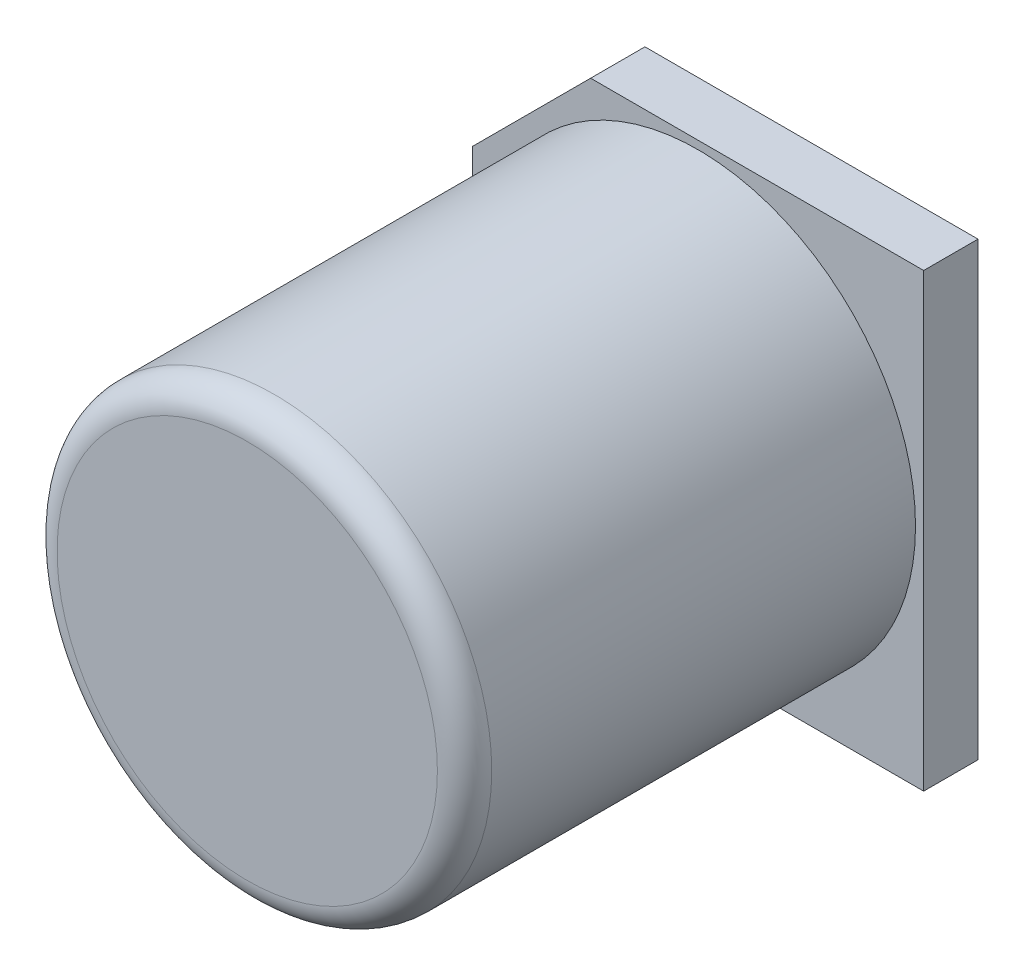
ISO-10303-21;
HEADER;
FILE_DESCRIPTION(('STEP AP214'),'2;1');
FILE_NAME('part.step','',(''),(''),'','','');
FILE_SCHEMA(('AUTOMOTIVE_DESIGN { 1 0 10303 214 1 1 1 1 }'));
ENDSEC;
DATA;
#1=APPLICATION_CONTEXT('core data for automotive mechanical design processes');
#2=APPLICATION_PROTOCOL_DEFINITION('international standard','automotive_design',2000,#1);
#3=PRODUCT_CONTEXT('',#1,'mechanical');
#4=PRODUCT('Part','Part','',(#3));
#5=PRODUCT_RELATED_PRODUCT_CATEGORY('part','',(#4));
#6=PRODUCT_DEFINITION_FORMATION('','',#4);
#7=PRODUCT_DEFINITION_CONTEXT('part definition',#1,'design');
#8=PRODUCT_DEFINITION('design','',#6,#7);
#9=PRODUCT_DEFINITION_SHAPE('','',#8);
#10=(LENGTH_UNIT() NAMED_UNIT(*) SI_UNIT(.MILLI.,.METRE.));
#11=(NAMED_UNIT(*) PLANE_ANGLE_UNIT() SI_UNIT($,.RADIAN.));
#12=(NAMED_UNIT(*) SI_UNIT($,.STERADIAN.) SOLID_ANGLE_UNIT());
#13=UNCERTAINTY_MEASURE_WITH_UNIT(LENGTH_MEASURE(1.E-05),#10,'distance_accuracy_value','');
#14=(GEOMETRIC_REPRESENTATION_CONTEXT(3) GLOBAL_UNCERTAINTY_ASSIGNED_CONTEXT((#13)) GLOBAL_UNIT_ASSIGNED_CONTEXT((#10,
#11,#12)) REPRESENTATION_CONTEXT('',''));
#15=CARTESIAN_POINT('',(0.,0.,0.));
#16=DIRECTION('',(0.,0.,1.));
#17=DIRECTION('',(1.,0.,0.));
#18=AXIS2_PLACEMENT_3D('',#15,#16,#17);
#19=CARTESIAN_POINT('',(4.15,4.15,1.));
#20=DIRECTION('',(-1.,0.,0.));
#21=DIRECTION('',(0.,0.,1.));
#22=AXIS2_PLACEMENT_3D('',#19,#20,#21);
#23=PLANE('',#22);
#24=DIRECTION('',(0.,1.,0.));
#25=VECTOR('',#24,1.);
#26=CARTESIAN_POINT('',(4.15,4.15,0.));
#27=LINE('',#26,#25);
#28=CARTESIAN_POINT('',(4.15,-4.15,0.));
#29=VERTEX_POINT('',#28);
#30=CARTESIAN_POINT('',(4.15,4.15,0.));
#31=VERTEX_POINT('',#30);
#32=EDGE_CURVE('E120',#29,#31,#27,.T.);
#33=ORIENTED_EDGE('',*,*,#32,.T.);
#34=DIRECTION('',(0.,0.,-1.));
#35=VECTOR('',#34,1.);
#36=CARTESIAN_POINT('',(4.15,4.15,1.));
#37=LINE('',#36,#35);
#38=CARTESIAN_POINT('',(4.15,4.15,1.));
#39=VERTEX_POINT('',#38);
#40=EDGE_CURVE('E137',#39,#31,#37,.T.);
#41=ORIENTED_EDGE('',*,*,#40,.F.);
#42=DIRECTION('',(0.,1.,0.));
#43=VECTOR('',#42,1.);
#44=CARTESIAN_POINT('',(4.15,4.15,1.));
#45=LINE('',#44,#43);
#46=CARTESIAN_POINT('',(4.15,-4.15,1.));
#47=VERTEX_POINT('',#46);
#48=EDGE_CURVE('E130',#47,#39,#45,.T.);
#49=ORIENTED_EDGE('',*,*,#48,.F.);
#50=DIRECTION('',(0.,0.,-1.));
#51=VECTOR('',#50,1.);
#52=CARTESIAN_POINT('',(4.15,-4.15,1.));
#53=LINE('',#52,#51);
#54=EDGE_CURVE('E116',#47,#29,#53,.T.);
#55=ORIENTED_EDGE('',*,*,#54,.T.);
#56=EDGE_LOOP('',(#33,#41,#49,#55));
#57=FACE_BOUND('',#56,.T.);
#58=ADVANCED_FACE('F34',(#57),#23,.F.);
#59=CARTESIAN_POINT('',(4.15,4.15,1.));
#60=DIRECTION('',(0.,-1.,0.));
#61=DIRECTION('',(1.,0.,0.));
#62=AXIS2_PLACEMENT_3D('',#59,#60,#61);
#63=PLANE('',#62);
#64=DIRECTION('',(-1.,0.,0.));
#65=VECTOR('',#64,1.);
#66=CARTESIAN_POINT('',(4.15,4.15,0.));
#67=LINE('',#66,#65);
#68=CARTESIAN_POINT('',(-1.98,4.15,0.));
#69=VERTEX_POINT('',#68);
#70=EDGE_CURVE('E123',#31,#69,#67,.T.);
#71=ORIENTED_EDGE('',*,*,#70,.T.);
#72=DIRECTION('',(0.,0.,-1.));
#73=VECTOR('',#72,1.);
#74=CARTESIAN_POINT('',(-1.98,4.15,1.));
#75=LINE('',#74,#73);
#76=CARTESIAN_POINT('',(-1.98,4.15,1.));
#77=VERTEX_POINT('',#76);
#78=EDGE_CURVE('E134',#77,#69,#75,.T.);
#79=ORIENTED_EDGE('',*,*,#78,.F.);
#80=DIRECTION('',(-1.,0.,0.));
#81=VECTOR('',#80,1.);
#82=CARTESIAN_POINT('',(4.15,4.15,1.));
#83=LINE('',#82,#81);
#84=EDGE_CURVE('E89',#39,#77,#83,.T.);
#85=ORIENTED_EDGE('',*,*,#84,.F.);
#86=ORIENTED_EDGE('',*,*,#40,.T.);
#87=EDGE_LOOP('',(#71,#79,#85,#86));
#88=FACE_BOUND('',#87,.T.);
#89=ADVANCED_FACE('F150',(#88),#63,.F.);
#90=CARTESIAN_POINT('',(-1.98,4.15,1.));
#91=DIRECTION('',(0.707106781186548,-0.707106781186547,0.));
#92=DIRECTION('',(0.707106781186547,0.707106781186548,0.));
#93=AXIS2_PLACEMENT_3D('',#90,#91,#92);
#94=PLANE('',#93);
#95=DIRECTION('',(-0.707106781186547,-0.707106781186548,0.));
#96=VECTOR('',#95,1.);
#97=CARTESIAN_POINT('',(-1.98,4.15,0.));
#98=LINE('',#97,#96);
#99=CARTESIAN_POINT('',(-4.15,1.98,0.));
#100=VERTEX_POINT('',#99);
#101=EDGE_CURVE('E125',#69,#100,#98,.T.);
#102=ORIENTED_EDGE('',*,*,#101,.T.);
#103=DIRECTION('',(0.,0.,-1.));
#104=VECTOR('',#103,1.);
#105=CARTESIAN_POINT('',(-4.15,1.98,1.));
#106=LINE('',#105,#104);
#107=CARTESIAN_POINT('',(-4.15,1.98,1.));
#108=VERTEX_POINT('',#107);
#109=EDGE_CURVE('E111',#108,#100,#106,.T.);
#110=ORIENTED_EDGE('',*,*,#109,.F.);
#111=DIRECTION('',(-0.707106781186547,-0.707106781186548,0.));
#112=VECTOR('',#111,1.);
#113=CARTESIAN_POINT('',(-1.98,4.15,1.));
#114=LINE('',#113,#112);
#115=EDGE_CURVE('E102',#77,#108,#114,.T.);
#116=ORIENTED_EDGE('',*,*,#115,.F.);
#117=ORIENTED_EDGE('',*,*,#78,.T.);
#118=EDGE_LOOP('',(#102,#110,#116,#117));
#119=FACE_BOUND('',#118,.T.);
#120=ADVANCED_FACE('F153',(#119),#94,.F.);
#121=CARTESIAN_POINT('',(-4.15,1.98,1.));
#122=DIRECTION('',(1.,0.,0.));
#123=DIRECTION('',(0.,1.,0.));
#124=AXIS2_PLACEMENT_3D('',#121,#122,#123);
#125=PLANE('',#124);
#126=DIRECTION('',(0.,-1.,0.));
#127=VECTOR('',#126,1.);
#128=CARTESIAN_POINT('',(-4.15,1.98,0.));
#129=LINE('',#128,#127);
#130=CARTESIAN_POINT('',(-4.15,-1.98,0.));
#131=VERTEX_POINT('',#130);
#132=EDGE_CURVE('E110',#100,#131,#129,.T.);
#133=ORIENTED_EDGE('',*,*,#132,.T.);
#134=DIRECTION('',(0.,0.,-1.));
#135=VECTOR('',#134,1.);
#136=CARTESIAN_POINT('',(-4.15,-1.98,1.));
#137=LINE('',#136,#135);
#138=CARTESIAN_POINT('',(-4.15,-1.98,1.));
#139=VERTEX_POINT('',#138);
#140=EDGE_CURVE('E107',#139,#131,#137,.T.);
#141=ORIENTED_EDGE('',*,*,#140,.F.);
#142=DIRECTION('',(0.,-1.,0.));
#143=VECTOR('',#142,1.);
#144=CARTESIAN_POINT('',(-4.15,1.98,1.));
#145=LINE('',#144,#143);
#146=EDGE_CURVE('E96',#108,#139,#145,.T.);
#147=ORIENTED_EDGE('',*,*,#146,.F.);
#148=ORIENTED_EDGE('',*,*,#109,.T.);
#149=EDGE_LOOP('',(#133,#141,#147,#148));
#150=FACE_BOUND('',#149,.T.);
#151=ADVANCED_FACE('F108',(#150),#125,.F.);
#152=CARTESIAN_POINT('',(-1.98,-4.15,1.));
#153=DIRECTION('',(0.707106781186547,0.707106781186548,0.));
#154=DIRECTION('',(-0.707106781186548,0.707106781186547,0.));
#155=AXIS2_PLACEMENT_3D('',#152,#153,#154);
#156=PLANE('',#155);
#157=DIRECTION('',(0.707106781186548,-0.707106781186547,0.));
#158=VECTOR('',#157,1.);
#159=CARTESIAN_POINT('',(-1.98,-4.15,0.));
#160=LINE('',#159,#158);
#161=CARTESIAN_POINT('',(-1.98,-4.15,0.));
#162=VERTEX_POINT('',#161);
#163=EDGE_CURVE('E74',#131,#162,#160,.T.);
#164=ORIENTED_EDGE('',*,*,#163,.T.);
#165=DIRECTION('',(0.,0.,-1.));
#166=VECTOR('',#165,1.);
#167=CARTESIAN_POINT('',(-1.98,-4.15,1.));
#168=LINE('',#167,#166);
#169=CARTESIAN_POINT('',(-1.98,-4.15,1.));
#170=VERTEX_POINT('',#169);
#171=EDGE_CURVE('E112',#170,#162,#168,.T.);
#172=ORIENTED_EDGE('',*,*,#171,.F.);
#173=DIRECTION('',(0.707106781186548,-0.707106781186547,0.));
#174=VECTOR('',#173,1.);
#175=CARTESIAN_POINT('',(-1.98,-4.15,1.));
#176=LINE('',#175,#174);
#177=EDGE_CURVE('E100',#139,#170,#176,.T.);
#178=ORIENTED_EDGE('',*,*,#177,.F.);
#179=ORIENTED_EDGE('',*,*,#140,.T.);
#180=EDGE_LOOP('',(#164,#172,#178,#179));
#181=FACE_BOUND('',#180,.T.);
#182=ADVANCED_FACE('F114',(#181),#156,.F.);
#183=CARTESIAN_POINT('',(4.15,-4.15,1.));
#184=DIRECTION('',(0.,1.,0.));
#185=DIRECTION('',(-1.,0.,0.));
#186=AXIS2_PLACEMENT_3D('',#183,#184,#185);
#187=PLANE('',#186);
#188=DIRECTION('',(1.,0.,0.));
#189=VECTOR('',#188,1.);
#190=CARTESIAN_POINT('',(4.15,-4.15,0.));
#191=LINE('',#190,#189);
#192=EDGE_CURVE('E80',#162,#29,#191,.T.);
#193=ORIENTED_EDGE('',*,*,#192,.T.);
#194=ORIENTED_EDGE('',*,*,#54,.F.);
#195=DIRECTION('',(1.,0.,0.));
#196=VECTOR('',#195,1.);
#197=CARTESIAN_POINT('',(4.15,-4.15,1.));
#198=LINE('',#197,#196);
#199=EDGE_CURVE('E51',#170,#47,#198,.T.);
#200=ORIENTED_EDGE('',*,*,#199,.F.);
#201=ORIENTED_EDGE('',*,*,#171,.T.);
#202=EDGE_LOOP('',(#193,#194,#200,#201));
#203=FACE_BOUND('',#202,.T.);
#204=ADVANCED_FACE('F158',(#203),#187,.F.);
#205=CARTESIAN_POINT('',(0.,0.,1.));
#206=DIRECTION('',(0.,0.,-1.));
#207=DIRECTION('',(-1.,0.,0.));
#208=AXIS2_PLACEMENT_3D('',#205,#206,#207);
#209=PLANE('',#208);
#210=CARTESIAN_POINT('',(0.,0.,1.));
#211=DIRECTION('',(0.,0.,1.));
#212=DIRECTION('',(1.,0.,0.));
#213=AXIS2_PLACEMENT_3D('',#210,#211,#212);
#214=CIRCLE('',#213,4.);
#215=CARTESIAN_POINT('',(4.,0.,1.));
#216=VERTEX_POINT('',#215);
#217=EDGE_CURVE('E138',#216,#216,#214,.T.);
#218=ORIENTED_EDGE('',*,*,#217,.F.);
#219=EDGE_LOOP('',(#218));
#220=FACE_BOUND('',#219,.T.);
#221=ORIENTED_EDGE('',*,*,#48,.T.);
#222=ORIENTED_EDGE('',*,*,#84,.T.);
#223=ORIENTED_EDGE('',*,*,#115,.T.);
#224=ORIENTED_EDGE('',*,*,#146,.T.);
#225=ORIENTED_EDGE('',*,*,#177,.T.);
#226=ORIENTED_EDGE('',*,*,#199,.T.);
#227=EDGE_LOOP('',(#221,#222,#223,#224,#225,#226));
#228=FACE_BOUND('',#227,.T.);
#229=ADVANCED_FACE('F98',(#220,#228),#209,.F.);
#230=CARTESIAN_POINT('',(0.,0.,0.));
#231=DIRECTION('',(0.,0.,-1.));
#232=DIRECTION('',(-1.,0.,0.));
#233=AXIS2_PLACEMENT_3D('',#230,#231,#232);
#234=PLANE('',#233);
#235=ORIENTED_EDGE('',*,*,#32,.F.);
#236=ORIENTED_EDGE('',*,*,#192,.F.);
#237=ORIENTED_EDGE('',*,*,#163,.F.);
#238=ORIENTED_EDGE('',*,*,#132,.F.);
#239=ORIENTED_EDGE('',*,*,#101,.F.);
#240=ORIENTED_EDGE('',*,*,#70,.F.);
#241=EDGE_LOOP('',(#235,#236,#237,#238,#239,#240));
#242=FACE_BOUND('',#241,.T.);
#243=ADVANCED_FACE('F156',(#242),#234,.T.);
#244=CARTESIAN_POINT('',(0.,0.,9.3));
#245=DIRECTION('',(0.,0.,-1.));
#246=DIRECTION('',(-1.,0.,0.));
#247=AXIS2_PLACEMENT_3D('',#244,#245,#246);
#248=CYLINDRICAL_SURFACE('',#247,4.);
#249=CARTESIAN_POINT('',(0.,0.,8.8));
#250=DIRECTION('',(0.,0.,1.));
#251=DIRECTION('',(1.,0.,0.));
#252=AXIS2_PLACEMENT_3D('',#249,#250,#251);
#253=CIRCLE('',#252,4.);
#254=CARTESIAN_POINT('',(4.,0.,8.8));
#255=VERTEX_POINT('',#254);
#256=EDGE_CURVE('E11',#255,#255,#253,.F.);
#257=ORIENTED_EDGE('',*,*,#256,.T.);
#258=EDGE_LOOP('',(#257));
#259=FACE_BOUND('',#258,.T.);
#260=ORIENTED_EDGE('',*,*,#217,.T.);
#261=EDGE_LOOP('',(#260));
#262=FACE_BOUND('',#261,.T.);
#263=ADVANCED_FACE('F200',(#259,#262),#248,.T.);
#264=CARTESIAN_POINT('',(0.,0.,9.3));
#265=DIRECTION('',(0.,0.,1.));
#266=DIRECTION('',(1.,0.,0.));
#267=AXIS2_PLACEMENT_3D('',#264,#265,#266);
#268=PLANE('',#267);
#269=CARTESIAN_POINT('',(0.,0.,9.3));
#270=DIRECTION('',(0.,0.,1.));
#271=DIRECTION('',(1.,0.,0.));
#272=AXIS2_PLACEMENT_3D('',#269,#270,#271);
#273=CIRCLE('',#272,3.5);
#274=CARTESIAN_POINT('',(3.5,0.,9.3));
#275=VERTEX_POINT('',#274);
#276=EDGE_CURVE('E43',#275,#275,#273,.T.);
#277=ORIENTED_EDGE('',*,*,#276,.T.);
#278=EDGE_LOOP('',(#277));
#279=FACE_BOUND('',#278,.T.);
#280=ADVANCED_FACE('F213',(#279),#268,.T.);
#281=CARTESIAN_POINT('',(0.,0.,8.8));
#282=DIRECTION('',(0.,0.,1.));
#283=DIRECTION('',(1.,0.,0.));
#284=AXIS2_PLACEMENT_3D('',#281,#282,#283);
#285=TOROIDAL_SURFACE('',#284,3.5,0.5);
#286=ORIENTED_EDGE('',*,*,#256,.F.);
#287=EDGE_LOOP('',(#286));
#288=FACE_BOUND('',#287,.T.);
#289=ORIENTED_EDGE('',*,*,#276,.F.);
#290=EDGE_LOOP('',(#289));
#291=FACE_BOUND('',#290,.T.);
#292=ADVANCED_FACE('F36',(#288,#291),#285,.T.);
#293=CLOSED_SHELL('',(#58,#89,#120,#151,#182,#204,#229,#243,#263,#280,#292));
#294=MANIFOLD_SOLID_BREP('B2',#293);
#295=ADVANCED_BREP_SHAPE_REPRESENTATION('',(#18,#294),#14);
#296=SHAPE_DEFINITION_REPRESENTATION(#9,#295);
ENDSEC;
END-ISO-10303-21;
